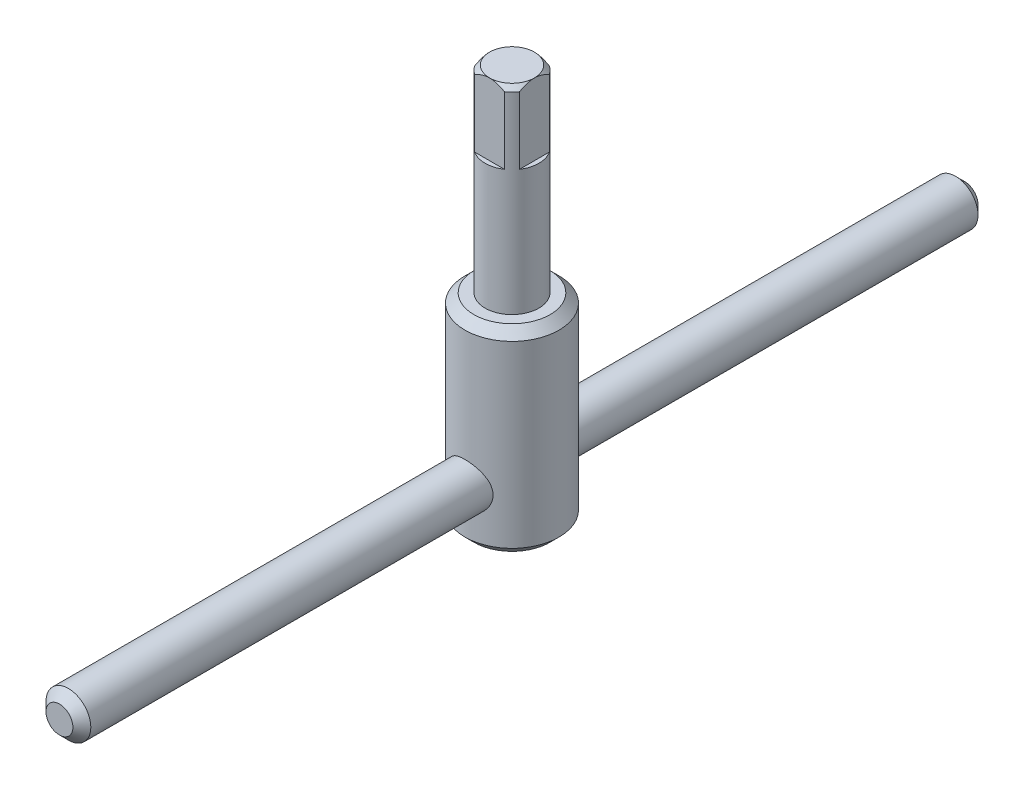
ISO-10303-21;
HEADER;
FILE_DESCRIPTION(('STEP AP214'),'2;1');
FILE_NAME('part.step','',(''),(''),'','','');
FILE_SCHEMA(('AUTOMOTIVE_DESIGN { 1 0 10303 214 1 1 1 1 }'));
ENDSEC;
DATA;
#1=APPLICATION_CONTEXT('core data for automotive mechanical design processes');
#2=APPLICATION_PROTOCOL_DEFINITION('international standard','automotive_design',2000,#1);
#3=PRODUCT_CONTEXT('',#1,'mechanical');
#4=PRODUCT('Part','Part','',(#3));
#5=PRODUCT_RELATED_PRODUCT_CATEGORY('part','',(#4));
#6=PRODUCT_DEFINITION_FORMATION('','',#4);
#7=PRODUCT_DEFINITION_CONTEXT('part definition',#1,'design');
#8=PRODUCT_DEFINITION('design','',#6,#7);
#9=PRODUCT_DEFINITION_SHAPE('','',#8);
#10=(LENGTH_UNIT() NAMED_UNIT(*) SI_UNIT(.MILLI.,.METRE.));
#11=(NAMED_UNIT(*) PLANE_ANGLE_UNIT() SI_UNIT($,.RADIAN.));
#12=(NAMED_UNIT(*) SI_UNIT($,.STERADIAN.) SOLID_ANGLE_UNIT());
#13=UNCERTAINTY_MEASURE_WITH_UNIT(LENGTH_MEASURE(1.E-05),#10,'distance_accuracy_value','');
#14=(GEOMETRIC_REPRESENTATION_CONTEXT(3) GLOBAL_UNCERTAINTY_ASSIGNED_CONTEXT((#13)) GLOBAL_UNIT_ASSIGNED_CONTEXT((#10,
#11,#12)) REPRESENTATION_CONTEXT('',''));
#15=CARTESIAN_POINT('',(0.,0.,0.));
#16=DIRECTION('',(0.,0.,1.));
#17=DIRECTION('',(1.,0.,0.));
#18=AXIS2_PLACEMENT_3D('',#15,#16,#17);
#19=CARTESIAN_POINT('',(0.,12.,101.));
#20=DIRECTION('',(0.,0.,-1.));
#21=DIRECTION('',(-1.,0.,0.));
#22=AXIS2_PLACEMENT_3D('',#19,#20,#21);
#23=CYLINDRICAL_SURFACE('',#22,5.);
#24=CARTESIAN_POINT('',(0.,12.,-99.0000000000001));
#25=DIRECTION('',(0.,0.,1.));
#26=DIRECTION('',(1.,0.,0.));
#27=AXIS2_PLACEMENT_3D('',#24,#25,#26);
#28=CIRCLE('',#27,5.);
#29=CARTESIAN_POINT('',(5.,12.,-99.0000000000001));
#30=VERTEX_POINT('',#29);
#31=EDGE_CURVE('E54',#30,#30,#28,.T.);
#32=ORIENTED_EDGE('',*,*,#31,.T.);
#33=EDGE_LOOP('',(#32));
#34=FACE_BOUND('',#33,.T.);
#35=CARTESIAN_POINT('',(0.,12.,99.));
#36=DIRECTION('',(0.,0.,1.));
#37=DIRECTION('',(1.,0.,0.));
#38=AXIS2_PLACEMENT_3D('',#35,#36,#37);
#39=CIRCLE('',#38,5.);
#40=CARTESIAN_POINT('',(5.,12.,99.));
#41=VERTEX_POINT('',#40);
#42=EDGE_CURVE('E58',#41,#41,#39,.F.);
#43=ORIENTED_EDGE('',*,*,#42,.T.);
#44=EDGE_LOOP('',(#43));
#45=FACE_BOUND('',#44,.T.);
#46=ADVANCED_FACE('F43',(#34,#45),#23,.T.);
#47=CARTESIAN_POINT('',(0.,12.,101.));
#48=DIRECTION('',(0.,0.,1.));
#49=DIRECTION('',(1.,0.,0.));
#50=AXIS2_PLACEMENT_3D('',#47,#48,#49);
#51=PLANE('',#50);
#52=CARTESIAN_POINT('',(0.,12.,101.));
#53=DIRECTION('',(0.,0.,1.));
#54=DIRECTION('',(1.,0.,0.));
#55=AXIS2_PLACEMENT_3D('',#52,#53,#54);
#56=CIRCLE('',#55,3.00000000000003);
#57=CARTESIAN_POINT('',(3.00000000000003,12.,101.));
#58=VERTEX_POINT('',#57);
#59=EDGE_CURVE('E11',#58,#58,#56,.T.);
#60=ORIENTED_EDGE('',*,*,#59,.T.);
#61=EDGE_LOOP('',(#60));
#62=FACE_BOUND('',#61,.T.);
#63=ADVANCED_FACE('F74',(#62),#51,.T.);
#64=CARTESIAN_POINT('',(0.,12.,-101.));
#65=DIRECTION('',(0.,0.,1.));
#66=DIRECTION('',(1.,0.,0.));
#67=AXIS2_PLACEMENT_3D('',#64,#65,#66);
#68=PLANE('',#67);
#69=CARTESIAN_POINT('',(0.,12.,-101.));
#70=DIRECTION('',(0.,0.,1.));
#71=DIRECTION('',(1.,0.,0.));
#72=AXIS2_PLACEMENT_3D('',#69,#70,#71);
#73=CIRCLE('',#72,3.00000000000006);
#74=CARTESIAN_POINT('',(3.00000000000006,12.,-101.));
#75=VERTEX_POINT('',#74);
#76=EDGE_CURVE('E50',#75,#75,#73,.F.);
#77=ORIENTED_EDGE('',*,*,#76,.T.);
#78=EDGE_LOOP('',(#77));
#79=FACE_BOUND('',#78,.T.);
#80=ADVANCED_FACE('F71',(#79),#68,.F.);
#81=CARTESIAN_POINT('',(0.,12.,-99.0000000000001));
#82=DIRECTION('',(0.,0.,1.));
#83=DIRECTION('',(1.,0.,0.));
#84=AXIS2_PLACEMENT_3D('',#81,#82,#83);
#85=CONICAL_SURFACE('',#84,5.,0.785398163397455);
#86=ORIENTED_EDGE('',*,*,#76,.F.);
#87=EDGE_LOOP('',(#86));
#88=FACE_BOUND('',#87,.T.);
#89=ORIENTED_EDGE('',*,*,#31,.F.);
#90=EDGE_LOOP('',(#89));
#91=FACE_BOUND('',#90,.T.);
#92=ADVANCED_FACE('F67',(#88,#91),#85,.T.);
#93=CARTESIAN_POINT('',(0.,12.,101.));
#94=DIRECTION('',(0.,0.,-1.));
#95=DIRECTION('',(-1.,0.,0.));
#96=AXIS2_PLACEMENT_3D('',#93,#94,#95);
#97=CONICAL_SURFACE('',#96,3.00000000000003,0.785398163397444);
#98=ORIENTED_EDGE('',*,*,#42,.F.);
#99=EDGE_LOOP('',(#98));
#100=FACE_BOUND('',#99,.T.);
#101=ORIENTED_EDGE('',*,*,#59,.F.);
#102=EDGE_LOOP('',(#101));
#103=FACE_BOUND('',#102,.T.);
#104=ADVANCED_FACE('F45',(#100,#103),#97,.T.);
#105=CLOSED_SHELL('',(#46,#63,#80,#92,#104));
#106=MANIFOLD_SOLID_BREP('B2',#105);
#107=CARTESIAN_POINT('',(0.,44.,0.));
#108=DIRECTION('',(0.,1.,0.));
#109=DIRECTION('',(0.,0.,1.));
#110=AXIS2_PLACEMENT_3D('',#107,#108,#109);
#111=PLANE('',#110);
#112=CARTESIAN_POINT('',(0.,44.,0.));
#113=DIRECTION('',(0.,1.,0.));
#114=DIRECTION('',(0.,0.,1.));
#115=AXIS2_PLACEMENT_3D('',#112,#113,#114);
#116=CIRCLE('',#115,8.50000000000001);
#117=CARTESIAN_POINT('',(0.,44.,8.50000000000001));
#118=VERTEX_POINT('',#117);
#119=EDGE_CURVE('E252',#118,#118,#116,.T.);
#120=ORIENTED_EDGE('',*,*,#119,.T.);
#121=EDGE_LOOP('',(#120));
#122=FACE_BOUND('',#121,.T.);
#123=CARTESIAN_POINT('',(0.,44.,0.));
#124=DIRECTION('',(0.,1.,0.));
#125=DIRECTION('',(0.,0.,1.));
#126=AXIS2_PLACEMENT_3D('',#123,#124,#125);
#127=CIRCLE('',#126,6.);
#128=CARTESIAN_POINT('',(0.,44.,6.));
#129=VERTEX_POINT('',#128);
#130=EDGE_CURVE('E247',#129,#129,#127,.T.);
#131=ORIENTED_EDGE('',*,*,#130,.F.);
#132=EDGE_LOOP('',(#131));
#133=FACE_BOUND('',#132,.T.);
#134=ADVANCED_FACE('F114',(#122,#133),#111,.T.);
#135=CARTESIAN_POINT('',(0.,44.,0.));
#136=DIRECTION('',(0.,-1.,0.));
#137=DIRECTION('',(0.,0.,-1.));
#138=AXIS2_PLACEMENT_3D('',#135,#136,#137);
#139=CYLINDRICAL_SURFACE('',#138,10.5);
#140=CARTESIAN_POINT('',(0.,42.,0.));
#141=DIRECTION('',(0.,1.,0.));
#142=DIRECTION('',(0.,0.,1.));
#143=AXIS2_PLACEMENT_3D('',#140,#141,#142);
#144=CIRCLE('',#143,10.5);
#145=CARTESIAN_POINT('',(0.,42.,10.5));
#146=VERTEX_POINT('',#145);
#147=EDGE_CURVE('E258',#146,#146,#144,.F.);
#148=ORIENTED_EDGE('',*,*,#147,.T.);
#149=EDGE_LOOP('',(#148));
#150=FACE_BOUND('',#149,.T.);
#151=CARTESIAN_POINT('',(0.,2.00000000000002,0.));
#152=DIRECTION('',(0.,1.,0.));
#153=DIRECTION('',(0.,0.,1.));
#154=AXIS2_PLACEMENT_3D('',#151,#152,#153);
#155=CIRCLE('',#154,10.5);
#156=CARTESIAN_POINT('',(0.,2.00000000000002,10.5));
#157=VERTEX_POINT('',#156);
#158=EDGE_CURVE('E255',#157,#157,#155,.T.);
#159=ORIENTED_EDGE('',*,*,#158,.T.);
#160=EDGE_LOOP('',(#159));
#161=FACE_BOUND('',#160,.T.);
#162=ADVANCED_FACE('F341',(#150,#161),#139,.T.);
#163=CARTESIAN_POINT('',(0.,0.,0.));
#164=DIRECTION('',(0.,1.,0.));
#165=DIRECTION('',(0.,0.,1.));
#166=AXIS2_PLACEMENT_3D('',#163,#164,#165);
#167=PLANE('',#166);
#168=CARTESIAN_POINT('',(0.,0.,0.));
#169=DIRECTION('',(0.,1.,0.));
#170=DIRECTION('',(0.,0.,1.));
#171=AXIS2_PLACEMENT_3D('',#168,#169,#170);
#172=CIRCLE('',#171,8.49999999999997);
#173=CARTESIAN_POINT('',(0.,0.,8.49999999999997));
#174=VERTEX_POINT('',#173);
#175=EDGE_CURVE('E261',#174,#174,#172,.F.);
#176=ORIENTED_EDGE('',*,*,#175,.T.);
#177=EDGE_LOOP('',(#176));
#178=FACE_BOUND('',#177,.T.);
#179=ADVANCED_FACE('F344',(#178),#167,.F.);
#180=CARTESIAN_POINT('',(0.,88.,0.));
#181=DIRECTION('',(0.,-1.,0.));
#182=DIRECTION('',(0.,0.,-1.));
#183=AXIS2_PLACEMENT_3D('',#180,#181,#182);
#184=CYLINDRICAL_SURFACE('',#183,6.);
#185=DIRECTION('',(0.,1.,0.));
#186=VECTOR('',#185,1.);
#187=CARTESIAN_POINT('',(3.31662479035541,72.,-5.));
#188=LINE('',#187,#186);
#189=CARTESIAN_POINT('',(3.31662479035541,72.,-5.));
#190=VERTEX_POINT('',#189);
#191=CARTESIAN_POINT('',(3.31662479035541,87.,-5.));
#192=VERTEX_POINT('',#191);
#193=EDGE_CURVE('E225',#190,#192,#188,.T.);
#194=ORIENTED_EDGE('',*,*,#193,.T.);
#195=CARTESIAN_POINT('',(0.,87.,0.));
#196=DIRECTION('',(0.,1.,0.));
#197=DIRECTION('',(0.,0.,1.));
#198=AXIS2_PLACEMENT_3D('',#195,#196,#197);
#199=CIRCLE('',#198,6.);
#200=CARTESIAN_POINT('',(5.,87.,-3.31662479035541));
#201=VERTEX_POINT('',#200);
#202=EDGE_CURVE('E142',#192,#201,#199,.F.);
#203=ORIENTED_EDGE('',*,*,#202,.T.);
#204=DIRECTION('',(0.,1.,0.));
#205=VECTOR('',#204,1.);
#206=CARTESIAN_POINT('',(5.,72.,-3.31662479035541));
#207=LINE('',#206,#205);
#208=CARTESIAN_POINT('',(5.,72.,-3.31662479035541));
#209=VERTEX_POINT('',#208);
#210=EDGE_CURVE('E234',#209,#201,#207,.T.);
#211=ORIENTED_EDGE('',*,*,#210,.F.);
#212=CARTESIAN_POINT('',(0.,72.,0.));
#213=DIRECTION('',(0.,1.,0.));
#214=DIRECTION('',(0.,0.,1.));
#215=AXIS2_PLACEMENT_3D('',#212,#213,#214);
#216=CIRCLE('',#215,6.);
#217=CARTESIAN_POINT('',(5.,72.,3.31662479035541));
#218=VERTEX_POINT('',#217);
#219=EDGE_CURVE('E227',#218,#209,#216,.T.);
#220=ORIENTED_EDGE('',*,*,#219,.F.);
#221=DIRECTION('',(0.,1.,0.));
#222=VECTOR('',#221,1.);
#223=CARTESIAN_POINT('',(5.,72.,3.31662479035541));
#224=LINE('',#223,#222);
#225=CARTESIAN_POINT('',(5.,87.,3.31662479035541));
#226=VERTEX_POINT('',#225);
#227=EDGE_CURVE('E235',#218,#226,#224,.T.);
#228=ORIENTED_EDGE('',*,*,#227,.T.);
#229=CARTESIAN_POINT('',(0.,87.,0.));
#230=DIRECTION('',(0.,1.,0.));
#231=DIRECTION('',(0.,0.,1.));
#232=AXIS2_PLACEMENT_3D('',#229,#230,#231);
#233=CIRCLE('',#232,6.);
#234=CARTESIAN_POINT('',(3.31662479035541,87.,5.));
#235=VERTEX_POINT('',#234);
#236=EDGE_CURVE('E215',#226,#235,#233,.F.);
#237=ORIENTED_EDGE('',*,*,#236,.T.);
#238=DIRECTION('',(0.,1.,0.));
#239=VECTOR('',#238,1.);
#240=CARTESIAN_POINT('',(3.31662479035541,72.,5.));
#241=LINE('',#240,#239);
#242=CARTESIAN_POINT('',(3.31662479035541,72.,5.));
#243=VERTEX_POINT('',#242);
#244=EDGE_CURVE('E208',#243,#235,#241,.T.);
#245=ORIENTED_EDGE('',*,*,#244,.F.);
#246=CARTESIAN_POINT('',(0.,72.,0.));
#247=DIRECTION('',(0.,1.,0.));
#248=DIRECTION('',(0.,0.,1.));
#249=AXIS2_PLACEMENT_3D('',#246,#247,#248);
#250=CIRCLE('',#249,6.);
#251=CARTESIAN_POINT('',(-3.3166247903554,72.,5.));
#252=VERTEX_POINT('',#251);
#253=EDGE_CURVE('E197',#252,#243,#250,.T.);
#254=ORIENTED_EDGE('',*,*,#253,.F.);
#255=DIRECTION('',(0.,1.,0.));
#256=VECTOR('',#255,1.);
#257=CARTESIAN_POINT('',(-3.3166247903554,72.,5.));
#258=LINE('',#257,#256);
#259=CARTESIAN_POINT('',(-3.3166247903554,87.,5.));
#260=VERTEX_POINT('',#259);
#261=EDGE_CURVE('E210',#252,#260,#258,.T.);
#262=ORIENTED_EDGE('',*,*,#261,.T.);
#263=CARTESIAN_POINT('',(0.,87.,0.));
#264=DIRECTION('',(0.,1.,0.));
#265=DIRECTION('',(0.,0.,1.));
#266=AXIS2_PLACEMENT_3D('',#263,#264,#265);
#267=CIRCLE('',#266,6.);
#268=CARTESIAN_POINT('',(-5.,87.,3.31662479035541));
#269=VERTEX_POINT('',#268);
#270=EDGE_CURVE('E509',#260,#269,#267,.F.);
#271=ORIENTED_EDGE('',*,*,#270,.T.);
#272=DIRECTION('',(0.,1.,0.));
#273=VECTOR('',#272,1.);
#274=CARTESIAN_POINT('',(-5.,72.,3.31662479035541));
#275=LINE('',#274,#273);
#276=CARTESIAN_POINT('',(-5.,72.,3.31662479035541));
#277=VERTEX_POINT('',#276);
#278=EDGE_CURVE('E243',#277,#269,#275,.T.);
#279=ORIENTED_EDGE('',*,*,#278,.F.);
#280=CARTESIAN_POINT('',(0.,72.,0.));
#281=DIRECTION('',(0.,1.,0.));
#282=DIRECTION('',(0.,0.,1.));
#283=AXIS2_PLACEMENT_3D('',#280,#281,#282);
#284=CIRCLE('',#283,6.);
#285=CARTESIAN_POINT('',(-5.,72.,-3.31662479035541));
#286=VERTEX_POINT('',#285);
#287=EDGE_CURVE('E237',#286,#277,#284,.T.);
#288=ORIENTED_EDGE('',*,*,#287,.F.);
#289=DIRECTION('',(0.,1.,0.));
#290=VECTOR('',#289,1.);
#291=CARTESIAN_POINT('',(-5.,72.,-3.31662479035541));
#292=LINE('',#291,#290);
#293=CARTESIAN_POINT('',(-5.,87.,-3.31662479035541));
#294=VERTEX_POINT('',#293);
#295=EDGE_CURVE('E244',#286,#294,#292,.T.);
#296=ORIENTED_EDGE('',*,*,#295,.T.);
#297=CARTESIAN_POINT('',(0.,87.,0.));
#298=DIRECTION('',(0.,1.,0.));
#299=DIRECTION('',(0.,0.,1.));
#300=AXIS2_PLACEMENT_3D('',#297,#298,#299);
#301=CIRCLE('',#300,6.);
#302=CARTESIAN_POINT('',(-3.31662479035541,87.,-5.));
#303=VERTEX_POINT('',#302);
#304=EDGE_CURVE('E510',#294,#303,#301,.F.);
#305=ORIENTED_EDGE('',*,*,#304,.T.);
#306=DIRECTION('',(0.,1.,0.));
#307=VECTOR('',#306,1.);
#308=CARTESIAN_POINT('',(-3.31662479035541,72.,-5.));
#309=LINE('',#308,#307);
#310=CARTESIAN_POINT('',(-3.31662479035541,72.,-5.));
#311=VERTEX_POINT('',#310);
#312=EDGE_CURVE('E224',#311,#303,#309,.T.);
#313=ORIENTED_EDGE('',*,*,#312,.F.);
#314=CARTESIAN_POINT('',(0.,72.,0.));
#315=DIRECTION('',(0.,1.,0.));
#316=DIRECTION('',(0.,0.,1.));
#317=AXIS2_PLACEMENT_3D('',#314,#315,#316);
#318=CIRCLE('',#317,6.);
#319=EDGE_CURVE('E217',#190,#311,#318,.T.);
#320=ORIENTED_EDGE('',*,*,#319,.F.);
#321=EDGE_LOOP('',(#194,#203,#211,#220,#228,#237,#245,#254,#262,#271,#279,#288,#296,#305,#313,#320));
#322=FACE_BOUND('',#321,.T.);
#323=ORIENTED_EDGE('',*,*,#130,.T.);
#324=EDGE_LOOP('',(#323));
#325=FACE_BOUND('',#324,.T.);
#326=ADVANCED_FACE('F212',(#322,#325),#184,.T.);
#327=CARTESIAN_POINT('',(0.,88.,0.));
#328=DIRECTION('',(0.,1.,0.));
#329=DIRECTION('',(0.,0.,1.));
#330=AXIS2_PLACEMENT_3D('',#327,#328,#329);
#331=PLANE('',#330);
#332=CARTESIAN_POINT('',(0.,88.,0.));
#333=DIRECTION('',(0.,1.,0.));
#334=DIRECTION('',(0.,0.,1.));
#335=AXIS2_PLACEMENT_3D('',#332,#333,#334);
#336=CIRCLE('',#335,4.99999999999999);
#337=CARTESIAN_POINT('',(0.,88.,5.));
#338=VERTEX_POINT('',#337);
#339=CARTESIAN_POINT('',(5.,88.,0.));
#340=VERTEX_POINT('',#339);
#341=EDGE_CURVE('E264',#338,#340,#336,.T.);
#342=ORIENTED_EDGE('',*,*,#341,.T.);
#343=CARTESIAN_POINT('',(0.,88.,0.));
#344=DIRECTION('',(0.,1.,0.));
#345=DIRECTION('',(0.,0.,1.));
#346=AXIS2_PLACEMENT_3D('',#343,#344,#345);
#347=CIRCLE('',#346,4.99999999999999);
#348=CARTESIAN_POINT('',(0.,88.,-5.));
#349=VERTEX_POINT('',#348);
#350=EDGE_CURVE('E273',#340,#349,#347,.T.);
#351=ORIENTED_EDGE('',*,*,#350,.T.);
#352=CARTESIAN_POINT('',(0.,88.,0.));
#353=DIRECTION('',(0.,1.,0.));
#354=DIRECTION('',(0.,0.,1.));
#355=AXIS2_PLACEMENT_3D('',#352,#353,#354);
#356=CIRCLE('',#355,4.99999999999999);
#357=CARTESIAN_POINT('',(-5.,88.,0.));
#358=VERTEX_POINT('',#357);
#359=EDGE_CURVE('E270',#349,#358,#356,.T.);
#360=ORIENTED_EDGE('',*,*,#359,.T.);
#361=CARTESIAN_POINT('',(0.,88.,0.));
#362=DIRECTION('',(0.,1.,0.));
#363=DIRECTION('',(0.,0.,1.));
#364=AXIS2_PLACEMENT_3D('',#361,#362,#363);
#365=CIRCLE('',#364,5.00000000000001);
#366=EDGE_CURVE('E267',#358,#338,#365,.T.);
#367=ORIENTED_EDGE('',*,*,#366,.T.);
#368=EDGE_LOOP('',(#342,#351,#360,#367));
#369=FACE_BOUND('',#368,.T.);
#370=ADVANCED_FACE('F354',(#369),#331,.T.);
#371=CARTESIAN_POINT('',(-5.,72.,-3.31662479035541));
#372=DIRECTION('',(1.,0.,0.));
#373=DIRECTION('',(0.,0.,-1.));
#374=AXIS2_PLACEMENT_3D('',#371,#372,#373);
#375=PLANE('',#374);
#376=CARTESIAN_POINT('',(-5.,87.,3.31662479035541));
#377=CARTESIAN_POINT('',(-5.,87.0500373169904,3.22609101803052));
#378=CARTESIAN_POINT('',(-5.,87.0989995322551,3.13495311040107));
#379=CARTESIAN_POINT('',(-5.,87.1944240482839,2.9514194918486));
#380=CARTESIAN_POINT('',(-5.,87.2408872068574,2.85902422634023));
#381=CARTESIAN_POINT('',(-5.,87.3311944859545,2.67245992501287));
#382=CARTESIAN_POINT('',(-5.,87.3750263638931,2.57828493109434));
#383=CARTESIAN_POINT('',(-5.,87.4594746196151,2.38844118263173));
#384=CARTESIAN_POINT('',(-5.,87.5000890994464,2.29277158566882));
#385=CARTESIAN_POINT('',(-5.,87.6143320741457,2.00871906771069));
#386=CARTESIAN_POINT('',(-5.,87.6828516855855,1.81823269013494));
#387=CARTESIAN_POINT('',(-5.,87.8022505188429,1.43185590891736));
#388=CARTESIAN_POINT('',(-5.,87.8531464202451,1.2359708054341));
#389=CARTESIAN_POINT('',(-5.,87.9106544825513,0.953085513764607));
#390=CARTESIAN_POINT('',(-5.,87.9259547689761,0.867809623329643));
#391=CARTESIAN_POINT('',(-5.,87.9524153653314,0.696604368410863));
#392=CARTESIAN_POINT('',(-5.,87.9635754509097,0.610674968771621));
#393=CARTESIAN_POINT('',(-5.,87.9816495223997,0.437419258030734));
#394=CARTESIAN_POINT('',(-5.,87.9885157478458,0.350087946096616));
#395=CARTESIAN_POINT('',(-5.,87.9976988030777,0.175172973164949));
#396=CARTESIAN_POINT('',(-5.,88.0000148879133,0.0875892731966519));
#397=CARTESIAN_POINT('',(-5.,88.,0.));
#398=B_SPLINE_CURVE_WITH_KNOTS('',3,(#376,#377,#378,#379,#380,#381,#382,#383,#384,#385,#386,
#387,#388,#389,#390,#391,#392,#393,#394,#395,#396,#397),.UNSPECIFIED.,.F.,.F.,(4,2,2,2,2,2,2,2,
2,2,4),(0.,0.310328932161112,0.620550654029966,0.932118820104369,1.2438694332414,
1.85049055337936,2.45653597054648,2.71636584969537,2.9762098066401,3.23889486253269,
3.50162292171019),.UNSPECIFIED.);
#399=EDGE_CURVE('E322',#269,#358,#398,.T.);
#400=ORIENTED_EDGE('',*,*,#399,.T.);
#401=CARTESIAN_POINT('',(-4.99999999999999,88.,0.));
#402=CARTESIAN_POINT('',(-5.,88.00000617326,-0.0768342850666813));
#403=CARTESIAN_POINT('',(-5.,87.9982280619993,-0.15365712757654));
#404=CARTESIAN_POINT('',(-5.,87.9911613614478,-0.307129286194606));
#405=CARTESIAN_POINT('',(-5.,87.9858733324629,-0.383778628040284));
#406=CARTESIAN_POINT('',(-5.,87.9648596892935,-0.612960203544632));
#407=CARTESIAN_POINT('',(-5.,87.9439840357443,-0.765045586600832));
#408=CARTESIAN_POINT('',(-5.,87.8900379911854,-1.06446596787188));
#409=CARTESIAN_POINT('',(-5.,87.8571680285904,-1.21183803867061));
#410=CARTESIAN_POINT('',(-5.,87.7806577812992,-1.50379337320135));
#411=CARTESIAN_POINT('',(-5.,87.7370132975944,-1.64837552591511));
#412=CARTESIAN_POINT('',(-5.,87.6444828831167,-1.92272263441548));
#413=CARTESIAN_POINT('',(-5.,87.5963161814298,-2.05273331241641));
#414=CARTESIAN_POINT('',(-5.,87.4933945412514,-2.31011118641954));
#415=CARTESIAN_POINT('',(-5.,87.438639320829,-2.43747826902538));
#416=CARTESIAN_POINT('',(-5.,87.3226900504812,-2.69162703776131));
#417=CARTESIAN_POINT('',(-5.,87.2614090176275,-2.81836872810256));
#418=CARTESIAN_POINT('',(-5.,87.1340700930522,-3.06932226319915));
#419=CARTESIAN_POINT('',(-5.,87.0680156304994,-3.19353584349453));
#420=CARTESIAN_POINT('',(-5.,87.,-3.31662479035541));
#421=B_SPLINE_CURVE_WITH_KNOTS('',3,(#401,#402,#403,#404,#405,#406,#407,#408,#409,#410,#411,
#412,#413,#414,#415,#416,#417,#418,#419,#420),.UNSPECIFIED.,.F.,.F.,(4,2,2,2,2,2,2,2,2,4),(0.,
0.230460410269724,0.460884039831831,0.920776109320099,1.37331103380715,1.82602259780303,
2.24175930969152,2.65751381780305,3.07974200846242,3.50166983486673),.UNSPECIFIED.);
#422=EDGE_CURVE('E362',#358,#294,#421,.T.);
#423=ORIENTED_EDGE('',*,*,#422,.T.);
#424=ORIENTED_EDGE('',*,*,#295,.F.);
#425=DIRECTION('',(0.,0.,-1.));
#426=VECTOR('',#425,1.);
#427=CARTESIAN_POINT('',(-5.,72.,-3.31662479035541));
#428=LINE('',#427,#426);
#429=EDGE_CURVE('E240',#277,#286,#428,.T.);
#430=ORIENTED_EDGE('',*,*,#429,.F.);
#431=ORIENTED_EDGE('',*,*,#278,.T.);
#432=EDGE_LOOP('',(#400,#423,#424,#430,#431));
#433=FACE_BOUND('',#432,.T.);
#434=ADVANCED_FACE('F356',(#433),#375,.F.);
#435=CARTESIAN_POINT('',(0.,72.,0.));
#436=DIRECTION('',(0.,1.,0.));
#437=DIRECTION('',(0.,0.,1.));
#438=AXIS2_PLACEMENT_3D('',#435,#436,#437);
#439=PLANE('',#438);
#440=ORIENTED_EDGE('',*,*,#287,.T.);
#441=ORIENTED_EDGE('',*,*,#429,.T.);
#442=EDGE_LOOP('',(#440,#441));
#443=FACE_BOUND('',#442,.T.);
#444=ADVANCED_FACE('F308',(#443),#439,.T.);
#445=CARTESIAN_POINT('',(5.,72.,-3.31662479035541));
#446=DIRECTION('',(-1.,0.,0.));
#447=DIRECTION('',(0.,0.,1.));
#448=AXIS2_PLACEMENT_3D('',#445,#446,#447);
#449=PLANE('',#448);
#450=ORIENTED_EDGE('',*,*,#210,.T.);
#451=CARTESIAN_POINT('',(5.,87.,-3.31662479035541));
#452=CARTESIAN_POINT('',(5.,87.0500373169904,-3.22609101803052));
#453=CARTESIAN_POINT('',(5.,87.0989995322551,-3.13495311040107));
#454=CARTESIAN_POINT('',(5.,87.1944240482839,-2.9514194918486));
#455=CARTESIAN_POINT('',(5.,87.2408872068574,-2.85902422634023));
#456=CARTESIAN_POINT('',(5.,87.3311944859544,-2.67245992501286));
#457=CARTESIAN_POINT('',(5.,87.3750263638931,-2.57828493109434));
#458=CARTESIAN_POINT('',(5.,87.4594746196151,-2.38844118263173));
#459=CARTESIAN_POINT('',(5.,87.5000890994464,-2.29277158566882));
#460=CARTESIAN_POINT('',(5.,87.6143320741457,-2.00871906771068));
#461=CARTESIAN_POINT('',(5.,87.6828516855855,-1.81823269013493));
#462=CARTESIAN_POINT('',(5.,87.8022505188429,-1.43185590891735));
#463=CARTESIAN_POINT('',(5.,87.8531464202451,-1.23597080543409));
#464=CARTESIAN_POINT('',(5.,87.9106544825513,-0.9530855137646));
#465=CARTESIAN_POINT('',(5.,87.925954768976,-0.867809623329635));
#466=CARTESIAN_POINT('',(5.,87.9524153653313,-0.696604368410856));
#467=CARTESIAN_POINT('',(5.,87.9635754509096,-0.610674968771615));
#468=CARTESIAN_POINT('',(5.,87.9816495223997,-0.437419258030729));
#469=CARTESIAN_POINT('',(5.,87.9885157478458,-0.350087946096611));
#470=CARTESIAN_POINT('',(5.,87.9976988030777,-0.175172973164944));
#471=CARTESIAN_POINT('',(5.,88.0000148879132,-0.0875892731966472));
#472=CARTESIAN_POINT('',(5.,88.,0.));
#473=B_SPLINE_CURVE_WITH_KNOTS('',3,(#451,#452,#453,#454,#455,#456,#457,#458,#459,#460,#461,
#462,#463,#464,#465,#466,#467,#468,#469,#470,#471,#472),.UNSPECIFIED.,.F.,.F.,(4,2,2,2,2,2,2,2,
2,2,4),(0.,0.310328932161097,0.620550654029958,0.93211882010437,1.2438694332414,
1.85049055337936,2.45653597054648,2.71636584969537,2.9762098066401,3.23889486253269,
3.50162292171019),.UNSPECIFIED.);
#474=EDGE_CURVE('E317',#201,#340,#473,.T.);
#475=ORIENTED_EDGE('',*,*,#474,.T.);
#476=CARTESIAN_POINT('',(4.99999999999999,88.,0.));
#477=CARTESIAN_POINT('',(5.,88.00000617326,0.0768342850666822));
#478=CARTESIAN_POINT('',(5.,87.9982280619993,0.153657127576541));
#479=CARTESIAN_POINT('',(5.,87.9911613614478,0.307129286194608));
#480=CARTESIAN_POINT('',(5.,87.9858733324629,0.383778628040285));
#481=CARTESIAN_POINT('',(5.,87.9648596892935,0.612960203544632));
#482=CARTESIAN_POINT('',(5.,87.9439840357443,0.765045586600832));
#483=CARTESIAN_POINT('',(5.,87.8900379911854,1.06446596787188));
#484=CARTESIAN_POINT('',(5.,87.8571680285904,1.21183803867061));
#485=CARTESIAN_POINT('',(5.,87.7806577812992,1.50379337320135));
#486=CARTESIAN_POINT('',(5.,87.7370132975944,1.64837552591511));
#487=CARTESIAN_POINT('',(5.,87.6444828831167,1.92272263441548));
#488=CARTESIAN_POINT('',(5.,87.5963161814298,2.05273331241641));
#489=CARTESIAN_POINT('',(5.,87.4933945412514,2.31011118641954));
#490=CARTESIAN_POINT('',(5.,87.438639320829,2.43747826902538));
#491=CARTESIAN_POINT('',(5.,87.3226900504812,2.6916270377613));
#492=CARTESIAN_POINT('',(5.,87.2614090176275,2.81836872810255));
#493=CARTESIAN_POINT('',(5.,87.1340700930522,3.06932226319914));
#494=CARTESIAN_POINT('',(5.,87.0680156304994,3.19353584349453));
#495=CARTESIAN_POINT('',(5.,87.,3.31662479035541));
#496=B_SPLINE_CURVE_WITH_KNOTS('',3,(#476,#477,#478,#479,#480,#481,#482,#483,#484,#485,#486,
#487,#488,#489,#490,#491,#492,#493,#494,#495),.UNSPECIFIED.,.F.,.F.,(4,2,2,2,2,2,2,2,2,4),(0.,
0.230460410269725,0.460884039831833,0.920776109320098,1.37331103380715,1.82602259780303,
2.24175930969152,2.65751381780305,3.07974200846242,3.50166983486673),.UNSPECIFIED.);
#497=EDGE_CURVE('E134',#340,#226,#496,.T.);
#498=ORIENTED_EDGE('',*,*,#497,.T.);
#499=ORIENTED_EDGE('',*,*,#227,.F.);
#500=DIRECTION('',(0.,0.,1.));
#501=VECTOR('',#500,1.);
#502=CARTESIAN_POINT('',(5.,72.,-3.31662479035541));
#503=LINE('',#502,#501);
#504=EDGE_CURVE('E231',#209,#218,#503,.T.);
#505=ORIENTED_EDGE('',*,*,#504,.F.);
#506=EDGE_LOOP('',(#450,#475,#498,#499,#505));
#507=FACE_BOUND('',#506,.T.);
#508=ADVANCED_FACE('F303',(#507),#449,.F.);
#509=CARTESIAN_POINT('',(0.,72.,0.));
#510=DIRECTION('',(0.,1.,0.));
#511=DIRECTION('',(0.,0.,1.));
#512=AXIS2_PLACEMENT_3D('',#509,#510,#511);
#513=PLANE('',#512);
#514=ORIENTED_EDGE('',*,*,#219,.T.);
#515=ORIENTED_EDGE('',*,*,#504,.T.);
#516=EDGE_LOOP('',(#514,#515));
#517=FACE_BOUND('',#516,.T.);
#518=ADVANCED_FACE('F298',(#517),#513,.T.);
#519=CARTESIAN_POINT('',(3.31662479035541,72.,-5.));
#520=DIRECTION('',(0.,0.,1.));
#521=DIRECTION('',(1.,0.,0.));
#522=AXIS2_PLACEMENT_3D('',#519,#520,#521);
#523=PLANE('',#522);
#524=CARTESIAN_POINT('',(-3.31662479035541,87.,-5.));
#525=CARTESIAN_POINT('',(-3.22609101803052,87.0500373169904,-5.));
#526=CARTESIAN_POINT('',(-3.13495311040107,87.0989995322551,-5.));
#527=CARTESIAN_POINT('',(-2.9514194918486,87.1944240482839,-5.));
#528=CARTESIAN_POINT('',(-2.85902422634023,87.2408872068574,-5.));
#529=CARTESIAN_POINT('',(-2.67245992501286,87.3311944859544,-5.));
#530=CARTESIAN_POINT('',(-2.57828493109434,87.3750263638931,-5.));
#531=CARTESIAN_POINT('',(-2.38844118263173,87.4594746196151,-5.));
#532=CARTESIAN_POINT('',(-2.29277158566882,87.5000890994464,-5.));
#533=CARTESIAN_POINT('',(-2.00871906771068,87.6143320741457,-5.));
#534=CARTESIAN_POINT('',(-1.81823269013493,87.6828516855855,-5.));
#535=CARTESIAN_POINT('',(-1.43185590891735,87.8022505188429,-5.));
#536=CARTESIAN_POINT('',(-1.23597080543409,87.8531464202451,-5.));
#537=CARTESIAN_POINT('',(-0.953085513764599,87.9106544825513,-5.));
#538=CARTESIAN_POINT('',(-0.867809623329635,87.925954768976,-5.));
#539=CARTESIAN_POINT('',(-0.696604368410856,87.9524153653313,-5.));
#540=CARTESIAN_POINT('',(-0.610674968771614,87.9635754509096,-5.));
#541=CARTESIAN_POINT('',(-0.437419258030729,87.9816495223997,-5.));
#542=CARTESIAN_POINT('',(-0.350087946096611,87.9885157478458,-5.));
#543=CARTESIAN_POINT('',(-0.175172973164944,87.9976988030777,-5.));
#544=CARTESIAN_POINT('',(-0.0875892731966472,88.0000148879132,-5.));
#545=CARTESIAN_POINT('',(0.,88.,-5.));
#546=B_SPLINE_CURVE_WITH_KNOTS('',3,(#524,#525,#526,#527,#528,#529,#530,#531,#532,#533,#534,
#535,#536,#537,#538,#539,#540,#541,#542,#543,#544,#545),.UNSPECIFIED.,.F.,.F.,(4,2,2,2,2,2,2,2,
2,2,4),(0.,0.310328932161097,0.620550654029958,0.93211882010437,1.2438694332414,
1.85049055337936,2.45653597054648,2.71636584969537,2.9762098066401,3.23889486253269,
3.50162292171019),.UNSPECIFIED.);
#547=EDGE_CURVE('E276',#303,#349,#546,.T.);
#548=ORIENTED_EDGE('',*,*,#547,.T.);
#549=CARTESIAN_POINT('',(0.,88.,-4.99999999999999));
#550=CARTESIAN_POINT('',(0.0768342850666822,88.00000617326,-5.));
#551=CARTESIAN_POINT('',(0.153657127576541,87.9982280619993,-5.));
#552=CARTESIAN_POINT('',(0.307129286194608,87.9911613614478,-5.));
#553=CARTESIAN_POINT('',(0.383778628040285,87.9858733324629,-5.));
#554=CARTESIAN_POINT('',(0.612960203544632,87.9648596892935,-5.));
#555=CARTESIAN_POINT('',(0.765045586600832,87.9439840357443,-5.));
#556=CARTESIAN_POINT('',(1.06446596787188,87.8900379911854,-5.));
#557=CARTESIAN_POINT('',(1.21183803867061,87.8571680285904,-5.));
#558=CARTESIAN_POINT('',(1.50379337320135,87.7806577812992,-5.));
#559=CARTESIAN_POINT('',(1.64837552591511,87.7370132975944,-5.));
#560=CARTESIAN_POINT('',(1.92272263441548,87.6444828831167,-5.));
#561=CARTESIAN_POINT('',(2.05273331241641,87.5963161814298,-5.));
#562=CARTESIAN_POINT('',(2.31011118641954,87.4933945412514,-5.));
#563=CARTESIAN_POINT('',(2.43747826902538,87.438639320829,-5.));
#564=CARTESIAN_POINT('',(2.6916270377613,87.3226900504812,-5.));
#565=CARTESIAN_POINT('',(2.81836872810255,87.2614090176275,-5.));
#566=CARTESIAN_POINT('',(3.06932226319914,87.1340700930522,-5.));
#567=CARTESIAN_POINT('',(3.19353584349453,87.0680156304994,-5.));
#568=CARTESIAN_POINT('',(3.31662479035541,87.,-5.));
#569=B_SPLINE_CURVE_WITH_KNOTS('',3,(#549,#550,#551,#552,#553,#554,#555,#556,#557,#558,#559,
#560,#561,#562,#563,#564,#565,#566,#567,#568),.UNSPECIFIED.,.F.,.F.,(4,2,2,2,2,2,2,2,2,4),(0.,
0.230460410269725,0.460884039831833,0.920776109320098,1.37331103380715,1.82602259780303,
2.24175930969152,2.65751381780305,3.07974200846242,3.50166983486673),.UNSPECIFIED.);
#570=EDGE_CURVE('E284',#349,#192,#569,.T.);
#571=ORIENTED_EDGE('',*,*,#570,.T.);
#572=ORIENTED_EDGE('',*,*,#193,.F.);
#573=DIRECTION('',(1.,0.,0.));
#574=VECTOR('',#573,1.);
#575=CARTESIAN_POINT('',(3.31662479035541,72.,-5.));
#576=LINE('',#575,#574);
#577=EDGE_CURVE('E221',#311,#190,#576,.T.);
#578=ORIENTED_EDGE('',*,*,#577,.F.);
#579=ORIENTED_EDGE('',*,*,#312,.T.);
#580=EDGE_LOOP('',(#548,#571,#572,#578,#579));
#581=FACE_BOUND('',#580,.T.);
#582=ADVANCED_FACE('F292',(#581),#523,.F.);
#583=CARTESIAN_POINT('',(0.,72.,0.));
#584=DIRECTION('',(0.,1.,0.));
#585=DIRECTION('',(0.,0.,1.));
#586=AXIS2_PLACEMENT_3D('',#583,#584,#585);
#587=PLANE('',#586);
#588=ORIENTED_EDGE('',*,*,#319,.T.);
#589=ORIENTED_EDGE('',*,*,#577,.T.);
#590=EDGE_LOOP('',(#588,#589));
#591=FACE_BOUND('',#590,.T.);
#592=ADVANCED_FACE('F297',(#591),#587,.T.);
#593=CARTESIAN_POINT('',(3.31662479035541,72.,5.));
#594=DIRECTION('',(0.,0.,-1.));
#595=DIRECTION('',(-1.,0.,0.));
#596=AXIS2_PLACEMENT_3D('',#593,#594,#595);
#597=PLANE('',#596);
#598=CARTESIAN_POINT('',(3.31662479035541,87.,5.));
#599=CARTESIAN_POINT('',(3.22609101803053,87.0500373169904,5.));
#600=CARTESIAN_POINT('',(3.13495311040108,87.0989995322551,5.));
#601=CARTESIAN_POINT('',(2.95141949184861,87.1944240482839,5.));
#602=CARTESIAN_POINT('',(2.85902422634023,87.2408872068574,5.));
#603=CARTESIAN_POINT('',(2.67245992501286,87.3311944859544,5.));
#604=CARTESIAN_POINT('',(2.57828493109434,87.3750263638931,5.));
#605=CARTESIAN_POINT('',(2.38844118263173,87.4594746196151,5.));
#606=CARTESIAN_POINT('',(2.29277158566882,87.5000890994464,5.));
#607=CARTESIAN_POINT('',(2.00871906771068,87.6143320741457,5.));
#608=CARTESIAN_POINT('',(1.81823269013493,87.6828516855855,5.));
#609=CARTESIAN_POINT('',(1.43185590891735,87.8022505188429,5.));
#610=CARTESIAN_POINT('',(1.23597080543409,87.8531464202451,5.));
#611=CARTESIAN_POINT('',(0.9530855137646,87.9106544825513,5.));
#612=CARTESIAN_POINT('',(0.867809623329635,87.925954768976,5.));
#613=CARTESIAN_POINT('',(0.696604368410857,87.9524153653313,5.));
#614=CARTESIAN_POINT('',(0.610674968771615,87.9635754509096,5.));
#615=CARTESIAN_POINT('',(0.43741925803073,87.9816495223997,5.));
#616=CARTESIAN_POINT('',(0.350087946096612,87.9885157478458,5.));
#617=CARTESIAN_POINT('',(0.175172973164945,87.9976988030777,5.));
#618=CARTESIAN_POINT('',(0.0875892731966486,88.0000148879132,5.));
#619=CARTESIAN_POINT('',(0.,88.,5.));
#620=B_SPLINE_CURVE_WITH_KNOTS('',3,(#598,#599,#600,#601,#602,#603,#604,#605,#606,#607,#608,
#609,#610,#611,#612,#613,#614,#615,#616,#617,#618,#619),.UNSPECIFIED.,.F.,.F.,(4,2,2,2,2,2,2,2,
2,2,4),(0.,0.310328932161103,0.620550654029958,0.93211882010437,1.2438694332414,
1.85049055337936,2.45653597054648,2.71636584969537,2.9762098066401,3.23889486253269,
3.50162292171019),.UNSPECIFIED.);
#621=EDGE_CURVE('E127',#235,#338,#620,.T.);
#622=ORIENTED_EDGE('',*,*,#621,.T.);
#623=CARTESIAN_POINT('',(0.,88.,5.00000000000001));
#624=CARTESIAN_POINT('',(-0.0768342850666797,88.00000617326,5.));
#625=CARTESIAN_POINT('',(-0.153657127576537,87.9982280619993,5.));
#626=CARTESIAN_POINT('',(-0.307129286194601,87.9911613614478,5.));
#627=CARTESIAN_POINT('',(-0.383778628040277,87.9858733324629,5.));
#628=CARTESIAN_POINT('',(-0.612960203544622,87.9648596892935,5.));
#629=CARTESIAN_POINT('',(-0.76504558660082,87.9439840357443,5.));
#630=CARTESIAN_POINT('',(-1.06446596787186,87.8900379911854,5.));
#631=CARTESIAN_POINT('',(-1.21183803867059,87.8571680285904,5.));
#632=CARTESIAN_POINT('',(-1.50379337320133,87.7806577812992,5.));
#633=CARTESIAN_POINT('',(-1.64837552591509,87.7370132975944,5.));
#634=CARTESIAN_POINT('',(-1.92272263441546,87.6444828831167,5.));
#635=CARTESIAN_POINT('',(-2.05273331241638,87.5963161814299,5.));
#636=CARTESIAN_POINT('',(-2.31011118641952,87.4933945412514,5.));
#637=CARTESIAN_POINT('',(-2.43747826902536,87.438639320829,5.));
#638=CARTESIAN_POINT('',(-2.69162703776129,87.3226900504812,5.));
#639=CARTESIAN_POINT('',(-2.81836872810254,87.2614090176276,5.));
#640=CARTESIAN_POINT('',(-3.06932226319914,87.1340700930522,5.));
#641=CARTESIAN_POINT('',(-3.19353584349453,87.0680156304994,5.));
#642=CARTESIAN_POINT('',(-3.31662479035541,87.,5.));
#643=B_SPLINE_CURVE_WITH_KNOTS('',3,(#623,#624,#625,#626,#627,#628,#629,#630,#631,#632,#633,
#634,#635,#636,#637,#638,#639,#640,#641,#642),.UNSPECIFIED.,.F.,.F.,(4,2,2,2,2,2,2,2,2,4),(0.,
0.23046041026972,0.460884039831826,0.920776109320086,1.37331103380714,1.826022597803,
2.2417593096915,2.65751381780304,3.07974200846241,3.50166983486673),.UNSPECIFIED.);
#644=EDGE_CURVE('E41',#338,#260,#643,.T.);
#645=ORIENTED_EDGE('',*,*,#644,.T.);
#646=ORIENTED_EDGE('',*,*,#261,.F.);
#647=DIRECTION('',(-1.,0.,0.));
#648=VECTOR('',#647,1.);
#649=CARTESIAN_POINT('',(3.31662479035541,72.,5.));
#650=LINE('',#649,#648);
#651=EDGE_CURVE('E200',#243,#252,#650,.T.);
#652=ORIENTED_EDGE('',*,*,#651,.F.);
#653=ORIENTED_EDGE('',*,*,#244,.T.);
#654=EDGE_LOOP('',(#622,#645,#646,#652,#653));
#655=FACE_BOUND('',#654,.T.);
#656=ADVANCED_FACE('F207',(#655),#597,.F.);
#657=CARTESIAN_POINT('',(0.,72.,0.));
#658=DIRECTION('',(0.,1.,0.));
#659=DIRECTION('',(0.,0.,1.));
#660=AXIS2_PLACEMENT_3D('',#657,#658,#659);
#661=PLANE('',#660);
#662=ORIENTED_EDGE('',*,*,#253,.T.);
#663=ORIENTED_EDGE('',*,*,#651,.T.);
#664=EDGE_LOOP('',(#662,#663));
#665=FACE_BOUND('',#664,.T.);
#666=ADVANCED_FACE('F199',(#665),#661,.T.);
#667=CARTESIAN_POINT('',(0.,44.,0.));
#668=DIRECTION('',(0.,-1.,0.));
#669=DIRECTION('',(0.,0.,-1.));
#670=AXIS2_PLACEMENT_3D('',#667,#668,#669);
#671=CONICAL_SURFACE('',#670,8.50000000000001,0.785398163397446);
#672=ORIENTED_EDGE('',*,*,#147,.F.);
#673=EDGE_LOOP('',(#672));
#674=FACE_BOUND('',#673,.T.);
#675=ORIENTED_EDGE('',*,*,#119,.F.);
#676=EDGE_LOOP('',(#675));
#677=FACE_BOUND('',#676,.T.);
#678=ADVANCED_FACE('F336',(#674,#677),#671,.T.);
#679=CARTESIAN_POINT('',(0.,2.00000000000002,0.));
#680=DIRECTION('',(0.,1.,0.));
#681=DIRECTION('',(0.,0.,1.));
#682=AXIS2_PLACEMENT_3D('',#679,#680,#681);
#683=CONICAL_SURFACE('',#682,10.5,0.785398163397451);
#684=ORIENTED_EDGE('',*,*,#175,.F.);
#685=EDGE_LOOP('',(#684));
#686=FACE_BOUND('',#685,.T.);
#687=ORIENTED_EDGE('',*,*,#158,.F.);
#688=EDGE_LOOP('',(#687));
#689=FACE_BOUND('',#688,.T.);
#690=ADVANCED_FACE('F331',(#686,#689),#683,.T.);
#691=CARTESIAN_POINT('',(0.,88.,0.));
#692=DIRECTION('',(0.,-1.,0.));
#693=DIRECTION('',(0.,0.,-1.));
#694=AXIS2_PLACEMENT_3D('',#691,#692,#693);
#695=CONICAL_SURFACE('',#694,4.99999999999999,0.785398163397453);
#696=ORIENTED_EDGE('',*,*,#474,.F.);
#697=ORIENTED_EDGE('',*,*,#202,.F.);
#698=ORIENTED_EDGE('',*,*,#570,.F.);
#699=ORIENTED_EDGE('',*,*,#350,.F.);
#700=EDGE_LOOP('',(#696,#697,#698,#699));
#701=FACE_BOUND('',#700,.T.);
#702=ADVANCED_FACE('F327',(#701),#695,.T.);
#703=CARTESIAN_POINT('',(0.,88.,0.));
#704=DIRECTION('',(0.,-1.,0.));
#705=DIRECTION('',(0.,0.,-1.));
#706=AXIS2_PLACEMENT_3D('',#703,#704,#705);
#707=CONICAL_SURFACE('',#706,4.99999999999999,0.785398163397453);
#708=ORIENTED_EDGE('',*,*,#547,.F.);
#709=ORIENTED_EDGE('',*,*,#304,.F.);
#710=ORIENTED_EDGE('',*,*,#422,.F.);
#711=ORIENTED_EDGE('',*,*,#359,.F.);
#712=EDGE_LOOP('',(#708,#709,#710,#711));
#713=FACE_BOUND('',#712,.T.);
#714=ADVANCED_FACE('F290',(#713),#707,.T.);
#715=CARTESIAN_POINT('',(0.,88.,0.));
#716=DIRECTION('',(0.,-1.,0.));
#717=DIRECTION('',(0.,0.,-1.));
#718=AXIS2_PLACEMENT_3D('',#715,#716,#717);
#719=CONICAL_SURFACE('',#718,5.00000000000001,0.785398163397446);
#720=ORIENTED_EDGE('',*,*,#399,.F.);
#721=ORIENTED_EDGE('',*,*,#270,.F.);
#722=ORIENTED_EDGE('',*,*,#644,.F.);
#723=ORIENTED_EDGE('',*,*,#366,.F.);
#724=EDGE_LOOP('',(#720,#721,#722,#723));
#725=FACE_BOUND('',#724,.T.);
#726=ADVANCED_FACE('F402',(#725),#719,.T.);
#727=CARTESIAN_POINT('',(0.,88.,0.));
#728=DIRECTION('',(0.,-1.,0.));
#729=DIRECTION('',(0.,0.,-1.));
#730=AXIS2_PLACEMENT_3D('',#727,#728,#729);
#731=CONICAL_SURFACE('',#730,4.99999999999999,0.785398163397453);
#732=ORIENTED_EDGE('',*,*,#621,.F.);
#733=ORIENTED_EDGE('',*,*,#236,.F.);
#734=ORIENTED_EDGE('',*,*,#497,.F.);
#735=ORIENTED_EDGE('',*,*,#341,.F.);
#736=EDGE_LOOP('',(#732,#733,#734,#735));
#737=FACE_BOUND('',#736,.T.);
#738=ADVANCED_FACE('F116',(#737),#731,.T.);
#739=CLOSED_SHELL('',(#134,#162,#179,#326,#370,#434,#444,#508,#518,#582,#592,#656,#666,#678,
#690,#702,#714,#726,#738));
#740=MANIFOLD_SOLID_BREP('B6',#739);
#741=ADVANCED_BREP_SHAPE_REPRESENTATION('',(#18,#106,#740),#14);
#742=SHAPE_DEFINITION_REPRESENTATION(#9,#741);
ENDSEC;
END-ISO-10303-21;
